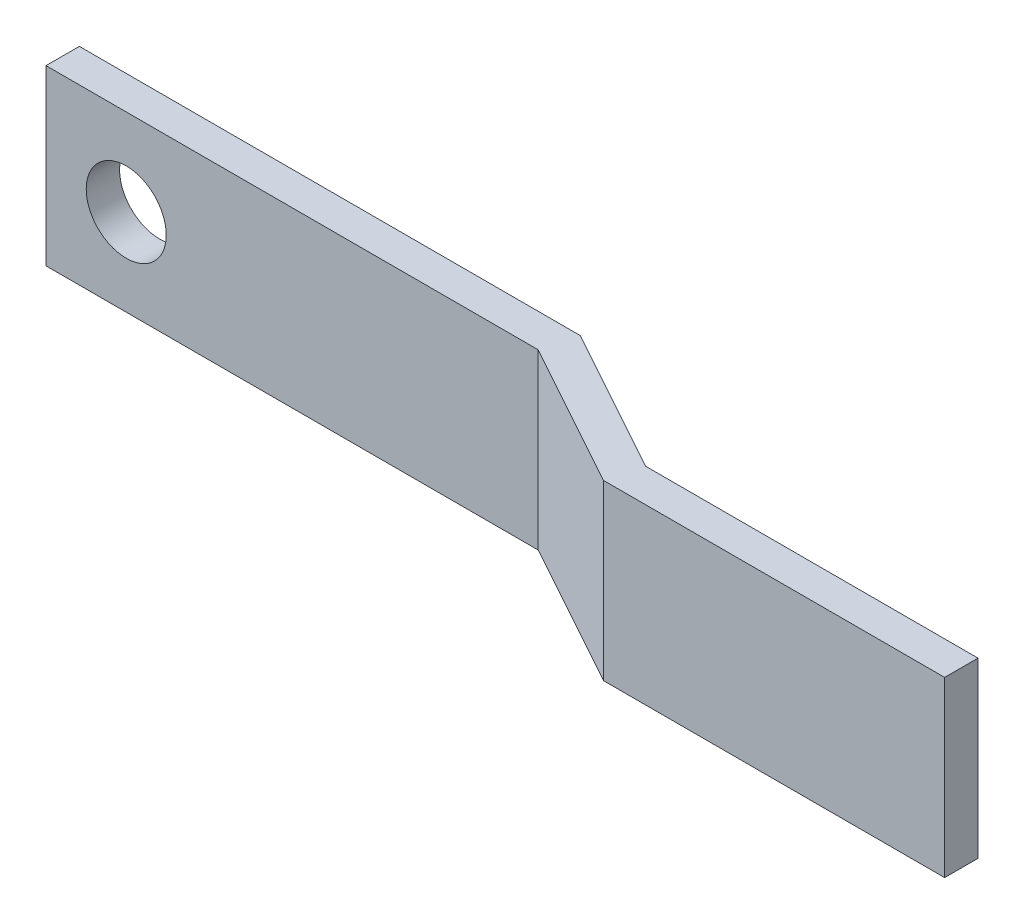
ISO-10303-21;
HEADER;
FILE_DESCRIPTION(('STEP AP214'),'2;1');
FILE_NAME('part.step','',(''),(''),'','','');
FILE_SCHEMA(('AUTOMOTIVE_DESIGN { 1 0 10303 214 1 1 1 1 }'));
ENDSEC;
DATA;
#1=APPLICATION_CONTEXT('core data for automotive mechanical design processes');
#2=APPLICATION_PROTOCOL_DEFINITION('international standard','automotive_design',2000,#1);
#3=PRODUCT_CONTEXT('',#1,'mechanical');
#4=PRODUCT('Part','Part','',(#3));
#5=PRODUCT_RELATED_PRODUCT_CATEGORY('part','',(#4));
#6=PRODUCT_DEFINITION_FORMATION('','',#4);
#7=PRODUCT_DEFINITION_CONTEXT('part definition',#1,'design');
#8=PRODUCT_DEFINITION('design','',#6,#7);
#9=PRODUCT_DEFINITION_SHAPE('','',#8);
#10=(LENGTH_UNIT() NAMED_UNIT(*) SI_UNIT(.MILLI.,.METRE.));
#11=(NAMED_UNIT(*) PLANE_ANGLE_UNIT() SI_UNIT($,.RADIAN.));
#12=(NAMED_UNIT(*) SI_UNIT($,.STERADIAN.) SOLID_ANGLE_UNIT());
#13=UNCERTAINTY_MEASURE_WITH_UNIT(LENGTH_MEASURE(1.E-05),#10,'distance_accuracy_value','');
#14=(GEOMETRIC_REPRESENTATION_CONTEXT(3) GLOBAL_UNCERTAINTY_ASSIGNED_CONTEXT((#13)) GLOBAL_UNIT_ASSIGNED_CONTEXT((#10,
#11,#12)) REPRESENTATION_CONTEXT('',''));
#15=CARTESIAN_POINT('',(0.,0.,0.));
#16=DIRECTION('',(0.,0.,1.));
#17=DIRECTION('',(1.,0.,0.));
#18=AXIS2_PLACEMENT_3D('',#15,#16,#17);
#19=CARTESIAN_POINT('',(49.2452703940796,13.208,8.66886869750178));
#20=DIRECTION('',(0.,0.,-1.));
#21=DIRECTION('',(-1.,0.,0.));
#22=AXIS2_PLACEMENT_3D('',#19,#20,#21);
#23=PLANE('',#22);
#24=DIRECTION('',(1.,0.,0.));
#25=VECTOR('',#24,1.);
#26=CARTESIAN_POINT('',(49.2452703940796,0.,8.66886869750178));
#27=LINE('',#26,#25);
#28=CARTESIAN_POINT('',(48.5909413517748,0.,8.66886869750178));
#29=VERTEX_POINT('',#28);
#30=CARTESIAN_POINT('',(74.5674344132872,0.,8.66886869750178));
#31=VERTEX_POINT('',#30);
#32=EDGE_CURVE('E135',#29,#31,#27,.T.);
#33=ORIENTED_EDGE('',*,*,#32,.T.);
#34=DIRECTION('',(0.,-1.,0.));
#35=VECTOR('',#34,1.);
#36=CARTESIAN_POINT('',(74.5674344132872,13.208,8.66886869750178));
#37=LINE('',#36,#35);
#38=CARTESIAN_POINT('',(74.5674344132872,13.208,8.66886869750178));
#39=VERTEX_POINT('',#38);
#40=EDGE_CURVE('E11',#39,#31,#37,.T.);
#41=ORIENTED_EDGE('',*,*,#40,.F.);
#42=DIRECTION('',(1.,0.,0.));
#43=VECTOR('',#42,1.);
#44=CARTESIAN_POINT('',(49.2452703940796,13.208,8.66886869750178));
#45=LINE('',#44,#43);
#46=CARTESIAN_POINT('',(48.5909413517748,13.208,8.66886869750178));
#47=VERTEX_POINT('',#46);
#48=EDGE_CURVE('E93',#47,#39,#45,.T.);
#49=ORIENTED_EDGE('',*,*,#48,.F.);
#50=DIRECTION('',(0.,-1.,0.));
#51=VECTOR('',#50,1.);
#52=CARTESIAN_POINT('',(48.5909413517748,13.208,8.66886869750178));
#53=LINE('',#52,#51);
#54=EDGE_CURVE('E134',#47,#29,#53,.T.);
#55=ORIENTED_EDGE('',*,*,#54,.T.);
#56=EDGE_LOOP('',(#33,#41,#49,#55));
#57=FACE_BOUND('',#56,.T.);
#58=ADVANCED_FACE('F38',(#57),#23,.F.);
#59=CARTESIAN_POINT('',(74.5674344132872,13.208,6.12886869750177));
#60=DIRECTION('',(1.,0.,0.));
#61=DIRECTION('',(0.,0.,-1.));
#62=AXIS2_PLACEMENT_3D('',#59,#60,#61);
#63=PLANE('',#62);
#64=DIRECTION('',(0.,0.,1.));
#65=VECTOR('',#64,1.);
#66=CARTESIAN_POINT('',(74.5674344132872,0.,6.12886869750177));
#67=LINE('',#66,#65);
#68=CARTESIAN_POINT('',(74.5674344132872,0.,6.12886869750177));
#69=VERTEX_POINT('',#68);
#70=EDGE_CURVE('E138',#69,#31,#67,.T.);
#71=ORIENTED_EDGE('',*,*,#70,.F.);
#72=DIRECTION('',(0.,-1.,0.));
#73=VECTOR('',#72,1.);
#74=CARTESIAN_POINT('',(74.5674344132872,13.208,6.12886869750177));
#75=LINE('',#74,#73);
#76=CARTESIAN_POINT('',(74.5674344132872,13.208,6.12886869750177));
#77=VERTEX_POINT('',#76);
#78=EDGE_CURVE('E46',#77,#69,#75,.T.);
#79=ORIENTED_EDGE('',*,*,#78,.F.);
#80=DIRECTION('',(0.,0.,1.));
#81=VECTOR('',#80,1.);
#82=CARTESIAN_POINT('',(74.5674344132872,13.208,6.12886869750177));
#83=LINE('',#82,#81);
#84=EDGE_CURVE('E178',#77,#39,#83,.T.);
#85=ORIENTED_EDGE('',*,*,#84,.T.);
#86=ORIENTED_EDGE('',*,*,#40,.T.);
#87=EDGE_LOOP('',(#71,#79,#85,#86));
#88=FACE_BOUND('',#87,.T.);
#89=ADVANCED_FACE('F169',(#88),#63,.T.);
#90=CARTESIAN_POINT('',(49.2452703940796,13.208,6.12886869750177));
#91=DIRECTION('',(0.,0.,-1.));
#92=DIRECTION('',(-1.,0.,0.));
#93=AXIS2_PLACEMENT_3D('',#90,#91,#92);
#94=PLANE('',#93);
#95=DIRECTION('',(1.,0.,0.));
#96=VECTOR('',#95,1.);
#97=CARTESIAN_POINT('',(49.2452703940796,0.,6.12886869750177));
#98=LINE('',#97,#96);
#99=CARTESIAN_POINT('',(49.2452703940796,0.,6.12886869750177));
#100=VERTEX_POINT('',#99);
#101=EDGE_CURVE('E142',#100,#69,#98,.T.);
#102=ORIENTED_EDGE('',*,*,#101,.F.);
#103=DIRECTION('',(0.,-1.,0.));
#104=VECTOR('',#103,1.);
#105=CARTESIAN_POINT('',(49.2452703940796,13.208,6.12886869750177));
#106=LINE('',#105,#104);
#107=CARTESIAN_POINT('',(49.2452703940796,13.208,6.12886869750177));
#108=VERTEX_POINT('',#107);
#109=EDGE_CURVE('E159',#108,#100,#106,.T.);
#110=ORIENTED_EDGE('',*,*,#109,.F.);
#111=DIRECTION('',(1.,0.,0.));
#112=VECTOR('',#111,1.);
#113=CARTESIAN_POINT('',(49.2452703940796,13.208,6.12886869750177));
#114=LINE('',#113,#112);
#115=EDGE_CURVE('E166',#108,#77,#114,.T.);
#116=ORIENTED_EDGE('',*,*,#115,.T.);
#117=ORIENTED_EDGE('',*,*,#78,.T.);
#118=EDGE_LOOP('',(#102,#110,#116,#117));
#119=FACE_BOUND('',#118,.T.);
#120=ADVANCED_FACE('F164',(#119),#94,.T.);
#121=CARTESIAN_POINT('',(38.1390581049535,13.208,0.));
#122=DIRECTION('',(0.483156107137484,0.,-0.875534223280708));
#123=DIRECTION('',(-0.875534223280708,0.,-0.483156107137484));
#124=AXIS2_PLACEMENT_3D('',#121,#122,#123);
#125=PLANE('',#124);
#126=DIRECTION('',(0.875534223280708,0.,0.483156107137484));
#127=VECTOR('',#126,1.);
#128=CARTESIAN_POINT('',(38.1390581049535,0.,0.));
#129=LINE('',#128,#127);
#130=CARTESIAN_POINT('',(38.1390581049535,0.,0.));
#131=VERTEX_POINT('',#130);
#132=EDGE_CURVE('E145',#131,#100,#129,.T.);
#133=ORIENTED_EDGE('',*,*,#132,.F.);
#134=DIRECTION('',(0.,-1.,0.));
#135=VECTOR('',#134,1.);
#136=CARTESIAN_POINT('',(38.1390581049535,13.208,0.));
#137=LINE('',#136,#135);
#138=CARTESIAN_POINT('',(38.1390581049535,13.208,0.));
#139=VERTEX_POINT('',#138);
#140=EDGE_CURVE('E157',#139,#131,#137,.T.);
#141=ORIENTED_EDGE('',*,*,#140,.F.);
#142=DIRECTION('',(0.875534223280708,0.,0.483156107137484));
#143=VECTOR('',#142,1.);
#144=CARTESIAN_POINT('',(38.1390581049535,13.208,0.));
#145=LINE('',#144,#143);
#146=EDGE_CURVE('E129',#139,#108,#145,.T.);
#147=ORIENTED_EDGE('',*,*,#146,.T.);
#148=ORIENTED_EDGE('',*,*,#109,.T.);
#149=EDGE_LOOP('',(#133,#141,#147,#148));
#150=FACE_BOUND('',#149,.T.);
#151=ADVANCED_FACE('F176',(#150),#125,.T.);
#152=CARTESIAN_POINT('',(0.,13.208,0.));
#153=DIRECTION('',(0.,0.,-1.));
#154=DIRECTION('',(-1.,0.,0.));
#155=AXIS2_PLACEMENT_3D('',#152,#153,#154);
#156=PLANE('',#155);
#157=CARTESIAN_POINT('',(6.11062579811326,6.604,0.));
#158=DIRECTION('',(0.,0.,-1.));
#159=DIRECTION('',(-1.,0.,0.));
#160=AXIS2_PLACEMENT_3D('',#157,#158,#159);
#161=CIRCLE('',#160,3.048);
#162=CARTESIAN_POINT('',(3.06262579811326,6.604,0.));
#163=VERTEX_POINT('',#162);
#164=EDGE_CURVE('E185',#163,#163,#161,.T.);
#165=ORIENTED_EDGE('',*,*,#164,.F.);
#166=EDGE_LOOP('',(#165));
#167=FACE_BOUND('',#166,.T.);
#168=DIRECTION('',(1.,0.,0.));
#169=VECTOR('',#168,1.);
#170=CARTESIAN_POINT('',(0.,0.,0.));
#171=LINE('',#170,#169);
#172=CARTESIAN_POINT('',(0.,0.,0.));
#173=VERTEX_POINT('',#172);
#174=EDGE_CURVE('E148',#173,#131,#171,.T.);
#175=ORIENTED_EDGE('',*,*,#174,.F.);
#176=DIRECTION('',(0.,-1.,0.));
#177=VECTOR('',#176,1.);
#178=CARTESIAN_POINT('',(0.,13.208,0.));
#179=LINE('',#178,#177);
#180=CARTESIAN_POINT('',(0.,13.208,0.));
#181=VERTEX_POINT('',#180);
#182=EDGE_CURVE('E117',#181,#173,#179,.T.);
#183=ORIENTED_EDGE('',*,*,#182,.F.);
#184=DIRECTION('',(1.,0.,0.));
#185=VECTOR('',#184,1.);
#186=CARTESIAN_POINT('',(0.,13.208,0.));
#187=LINE('',#186,#185);
#188=EDGE_CURVE('E127',#181,#139,#187,.T.);
#189=ORIENTED_EDGE('',*,*,#188,.T.);
#190=ORIENTED_EDGE('',*,*,#140,.T.);
#191=EDGE_LOOP('',(#175,#183,#189,#190));
#192=FACE_BOUND('',#191,.T.);
#193=ADVANCED_FACE('F192',(#167,#192),#156,.T.);
#194=CARTESIAN_POINT('',(0.,13.208,2.54));
#195=DIRECTION('',(-1.,0.,0.));
#196=DIRECTION('',(0.,0.,1.));
#197=AXIS2_PLACEMENT_3D('',#194,#195,#196);
#198=PLANE('',#197);
#199=DIRECTION('',(0.,0.,-1.));
#200=VECTOR('',#199,1.);
#201=CARTESIAN_POINT('',(0.,0.,2.54));
#202=LINE('',#201,#200);
#203=CARTESIAN_POINT('',(0.,0.,2.54));
#204=VERTEX_POINT('',#203);
#205=EDGE_CURVE('E116',#204,#173,#202,.T.);
#206=ORIENTED_EDGE('',*,*,#205,.F.);
#207=DIRECTION('',(0.,-1.,0.));
#208=VECTOR('',#207,1.);
#209=CARTESIAN_POINT('',(0.,13.208,2.54));
#210=LINE('',#209,#208);
#211=CARTESIAN_POINT('',(0.,13.208,2.54));
#212=VERTEX_POINT('',#211);
#213=EDGE_CURVE('E110',#212,#204,#210,.T.);
#214=ORIENTED_EDGE('',*,*,#213,.F.);
#215=DIRECTION('',(0.,0.,-1.));
#216=VECTOR('',#215,1.);
#217=CARTESIAN_POINT('',(0.,13.208,2.54));
#218=LINE('',#217,#216);
#219=EDGE_CURVE('E114',#212,#181,#218,.T.);
#220=ORIENTED_EDGE('',*,*,#219,.T.);
#221=ORIENTED_EDGE('',*,*,#182,.T.);
#222=EDGE_LOOP('',(#206,#214,#220,#221));
#223=FACE_BOUND('',#222,.T.);
#224=ADVANCED_FACE('F112',(#223),#198,.T.);
#225=CARTESIAN_POINT('',(0.,13.208,2.54));
#226=DIRECTION('',(0.,0.,-1.));
#227=DIRECTION('',(-1.,0.,0.));
#228=AXIS2_PLACEMENT_3D('',#225,#226,#227);
#229=PLANE('',#228);
#230=CARTESIAN_POINT('',(6.11062579811326,6.604,2.54));
#231=DIRECTION('',(0.,0.,-1.));
#232=DIRECTION('',(-1.,0.,0.));
#233=AXIS2_PLACEMENT_3D('',#230,#231,#232);
#234=CIRCLE('',#233,3.048);
#235=CARTESIAN_POINT('',(3.06262579811326,6.604,2.54));
#236=VERTEX_POINT('',#235);
#237=EDGE_CURVE('E139',#236,#236,#234,.F.);
#238=ORIENTED_EDGE('',*,*,#237,.F.);
#239=EDGE_LOOP('',(#238));
#240=FACE_BOUND('',#239,.T.);
#241=DIRECTION('',(1.,0.,0.));
#242=VECTOR('',#241,1.);
#243=CARTESIAN_POINT('',(0.,0.,2.54));
#244=LINE('',#243,#242);
#245=CARTESIAN_POINT('',(37.4847290626487,0.,2.54));
#246=VERTEX_POINT('',#245);
#247=EDGE_CURVE('E81',#204,#246,#244,.T.);
#248=ORIENTED_EDGE('',*,*,#247,.T.);
#249=DIRECTION('',(0.,-1.,0.));
#250=VECTOR('',#249,1.);
#251=CARTESIAN_POINT('',(37.4847290626487,13.208,2.54));
#252=LINE('',#251,#250);
#253=CARTESIAN_POINT('',(37.4847290626487,13.208,2.54));
#254=VERTEX_POINT('',#253);
#255=EDGE_CURVE('E118',#254,#246,#252,.T.);
#256=ORIENTED_EDGE('',*,*,#255,.F.);
#257=DIRECTION('',(1.,0.,0.));
#258=VECTOR('',#257,1.);
#259=CARTESIAN_POINT('',(0.,13.208,2.54));
#260=LINE('',#259,#258);
#261=EDGE_CURVE('E120',#212,#254,#260,.T.);
#262=ORIENTED_EDGE('',*,*,#261,.F.);
#263=ORIENTED_EDGE('',*,*,#213,.T.);
#264=EDGE_LOOP('',(#248,#256,#262,#263));
#265=FACE_BOUND('',#264,.T.);
#266=ADVANCED_FACE('F121',(#240,#265),#229,.F.);
#267=CARTESIAN_POINT('',(36.9118415928243,13.208,2.223856927133));
#268=DIRECTION('',(0.483156107137484,0.,-0.875534223280708));
#269=DIRECTION('',(-0.875534223280708,0.,-0.483156107137484));
#270=AXIS2_PLACEMENT_3D('',#267,#268,#269);
#271=PLANE('',#270);
#272=DIRECTION('',(0.875534223280708,0.,0.483156107137484));
#273=VECTOR('',#272,1.);
#274=CARTESIAN_POINT('',(36.9118415928243,0.,2.223856927133));
#275=LINE('',#274,#273);
#276=EDGE_CURVE('E87',#246,#29,#275,.T.);
#277=ORIENTED_EDGE('',*,*,#276,.T.);
#278=ORIENTED_EDGE('',*,*,#54,.F.);
#279=DIRECTION('',(0.875534223280708,0.,0.483156107137484));
#280=VECTOR('',#279,1.);
#281=CARTESIAN_POINT('',(36.9118415928243,13.208,2.223856927133));
#282=LINE('',#281,#280);
#283=EDGE_CURVE('E54',#254,#47,#282,.T.);
#284=ORIENTED_EDGE('',*,*,#283,.F.);
#285=ORIENTED_EDGE('',*,*,#255,.T.);
#286=EDGE_LOOP('',(#277,#278,#284,#285));
#287=FACE_BOUND('',#286,.T.);
#288=ADVANCED_FACE('F197',(#287),#271,.F.);
#289=CARTESIAN_POINT('',(0.,13.208,0.));
#290=DIRECTION('',(0.,-1.,0.));
#291=DIRECTION('',(-1.,0.,0.));
#292=AXIS2_PLACEMENT_3D('',#289,#290,#291);
#293=PLANE('',#292);
#294=ORIENTED_EDGE('',*,*,#48,.T.);
#295=ORIENTED_EDGE('',*,*,#84,.F.);
#296=ORIENTED_EDGE('',*,*,#115,.F.);
#297=ORIENTED_EDGE('',*,*,#146,.F.);
#298=ORIENTED_EDGE('',*,*,#188,.F.);
#299=ORIENTED_EDGE('',*,*,#219,.F.);
#300=ORIENTED_EDGE('',*,*,#261,.T.);
#301=ORIENTED_EDGE('',*,*,#283,.T.);
#302=EDGE_LOOP('',(#294,#295,#296,#297,#298,#299,#300,#301));
#303=FACE_BOUND('',#302,.T.);
#304=ADVANCED_FACE('F124',(#303),#293,.F.);
#305=CARTESIAN_POINT('',(0.,0.,0.));
#306=DIRECTION('',(0.,-1.,0.));
#307=DIRECTION('',(-1.,0.,0.));
#308=AXIS2_PLACEMENT_3D('',#305,#306,#307);
#309=PLANE('',#308);
#310=ORIENTED_EDGE('',*,*,#32,.F.);
#311=ORIENTED_EDGE('',*,*,#276,.F.);
#312=ORIENTED_EDGE('',*,*,#247,.F.);
#313=ORIENTED_EDGE('',*,*,#205,.T.);
#314=ORIENTED_EDGE('',*,*,#174,.T.);
#315=ORIENTED_EDGE('',*,*,#132,.T.);
#316=ORIENTED_EDGE('',*,*,#101,.T.);
#317=ORIENTED_EDGE('',*,*,#70,.T.);
#318=EDGE_LOOP('',(#310,#311,#312,#313,#314,#315,#316,#317));
#319=FACE_BOUND('',#318,.T.);
#320=ADVANCED_FACE('F172',(#319),#309,.T.);
#321=CARTESIAN_POINT('',(6.11062579811326,6.604,8.66986869750177));
#322=DIRECTION('',(0.,0.,-1.));
#323=DIRECTION('',(-1.,0.,0.));
#324=AXIS2_PLACEMENT_3D('',#321,#322,#323);
#325=CYLINDRICAL_SURFACE('',#324,3.048);
#326=ORIENTED_EDGE('',*,*,#164,.T.);
#327=EDGE_LOOP('',(#326));
#328=FACE_BOUND('',#327,.T.);
#329=ORIENTED_EDGE('',*,*,#237,.T.);
#330=EDGE_LOOP('',(#329));
#331=FACE_BOUND('',#330,.T.);
#332=ADVANCED_FACE('F189',(#328,#331),#325,.F.);
#333=CLOSED_SHELL('',(#58,#89,#120,#151,#193,#224,#266,#288,#304,#320,#332));
#334=MANIFOLD_SOLID_BREP('B2',#333);
#335=ADVANCED_BREP_SHAPE_REPRESENTATION('',(#18,#334),#14);
#336=SHAPE_DEFINITION_REPRESENTATION(#9,#335);
ENDSEC;
END-ISO-10303-21;
